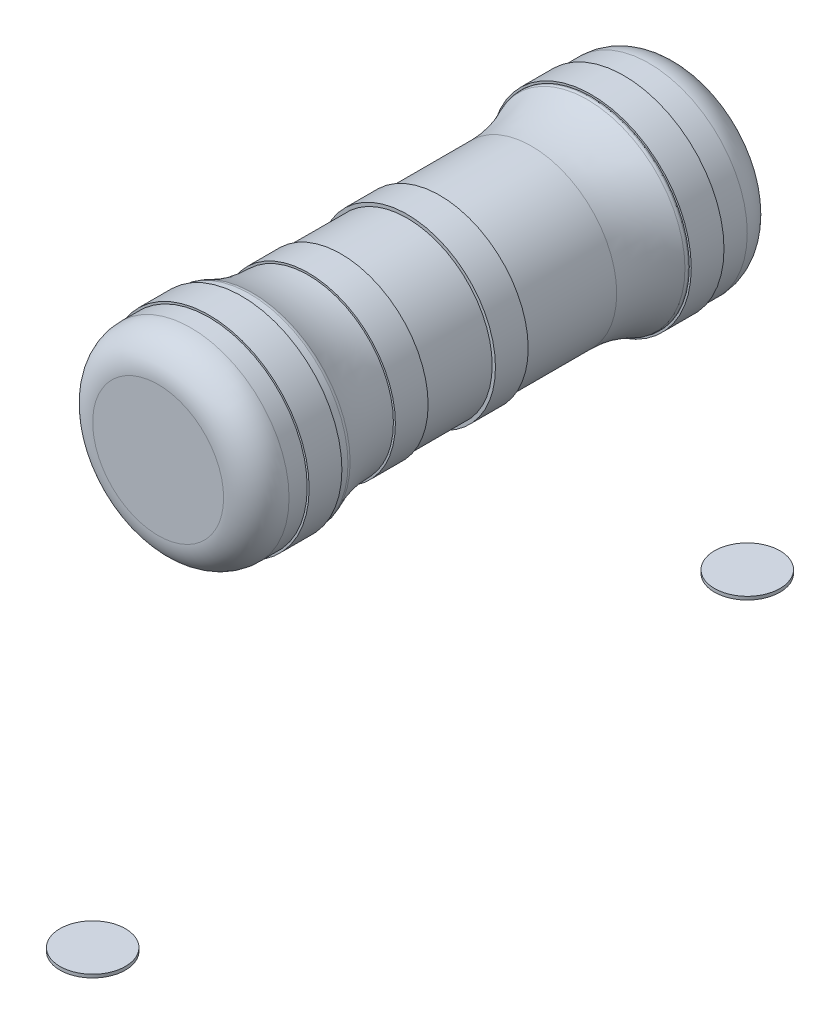
ISO-10303-21;
HEADER;
FILE_DESCRIPTION(('STEP AP214'),'2;1');
FILE_NAME('part.step','',(''),(''),'','','');
FILE_SCHEMA(('AUTOMOTIVE_DESIGN { 1 0 10303 214 1 1 1 1 }'));
ENDSEC;
DATA;
#1=APPLICATION_CONTEXT('core data for automotive mechanical design processes');
#2=APPLICATION_PROTOCOL_DEFINITION('international standard','automotive_design',2000,#1);
#3=PRODUCT_CONTEXT('',#1,'mechanical');
#4=PRODUCT('Part','Part','',(#3));
#5=PRODUCT_RELATED_PRODUCT_CATEGORY('part','',(#4));
#6=PRODUCT_DEFINITION_FORMATION('','',#4);
#7=PRODUCT_DEFINITION_CONTEXT('part definition',#1,'design');
#8=PRODUCT_DEFINITION('design','',#6,#7);
#9=PRODUCT_DEFINITION_SHAPE('','',#8);
#10=(LENGTH_UNIT() NAMED_UNIT(*) SI_UNIT(.MILLI.,.METRE.));
#11=(NAMED_UNIT(*) PLANE_ANGLE_UNIT() SI_UNIT($,.RADIAN.));
#12=(NAMED_UNIT(*) SI_UNIT($,.STERADIAN.) SOLID_ANGLE_UNIT());
#13=UNCERTAINTY_MEASURE_WITH_UNIT(LENGTH_MEASURE(1.E-05),#10,'distance_accuracy_value','');
#14=(GEOMETRIC_REPRESENTATION_CONTEXT(3) GLOBAL_UNCERTAINTY_ASSIGNED_CONTEXT((#13)) GLOBAL_UNIT_ASSIGNED_CONTEXT((#10,
#11,#12)) REPRESENTATION_CONTEXT('',''));
#15=CARTESIAN_POINT('',(0.,0.,0.));
#16=DIRECTION('',(0.,0.,1.));
#17=DIRECTION('',(1.,0.,0.));
#18=AXIS2_PLACEMENT_3D('',#15,#16,#17);
#19=CARTESIAN_POINT('',(0.,-5.95,5.));
#20=DIRECTION('',(0.,-1.,0.));
#21=DIRECTION('',(0.,0.,-1.));
#22=AXIS2_PLACEMENT_3D('',#19,#20,#21);
#23=CYLINDRICAL_SURFACE('',#22,0.5);
#24=CARTESIAN_POINT('',(0.,-5.95,5.));
#25=DIRECTION('',(0.,1.,0.));
#26=DIRECTION('',(0.,0.,1.));
#27=AXIS2_PLACEMENT_3D('',#24,#25,#26);
#28=CIRCLE('',#27,0.5);
#29=CARTESIAN_POINT('',(0.,-5.95,5.5));
#30=VERTEX_POINT('',#29);
#31=EDGE_CURVE('E11',#30,#30,#28,.T.);
#32=ORIENTED_EDGE('',*,*,#31,.F.);
#33=EDGE_LOOP('',(#32));
#34=FACE_BOUND('',#33,.T.);
#35=CARTESIAN_POINT('',(0.,-6.,5.));
#36=DIRECTION('',(0.,1.,0.));
#37=DIRECTION('',(0.,0.,1.));
#38=AXIS2_PLACEMENT_3D('',#35,#36,#37);
#39=CIRCLE('',#38,0.5);
#40=CARTESIAN_POINT('',(0.,-6.,5.5));
#41=VERTEX_POINT('',#40);
#42=EDGE_CURVE('E47',#41,#41,#39,.T.);
#43=ORIENTED_EDGE('',*,*,#42,.T.);
#44=EDGE_LOOP('',(#43));
#45=FACE_BOUND('',#44,.T.);
#46=ADVANCED_FACE('F44',(#34,#45),#23,.T.);
#47=CARTESIAN_POINT('',(0.,-5.95,0.));
#48=DIRECTION('',(0.,1.,0.));
#49=DIRECTION('',(0.,0.,1.));
#50=AXIS2_PLACEMENT_3D('',#47,#48,#49);
#51=PLANE('',#50);
#52=ORIENTED_EDGE('',*,*,#31,.T.);
#53=EDGE_LOOP('',(#52));
#54=FACE_BOUND('',#53,.T.);
#55=ADVANCED_FACE('F59',(#54),#51,.T.);
#56=CARTESIAN_POINT('',(0.,-6.,0.));
#57=DIRECTION('',(0.,1.,0.));
#58=DIRECTION('',(0.,0.,1.));
#59=AXIS2_PLACEMENT_3D('',#56,#57,#58);
#60=PLANE('',#59);
#61=ORIENTED_EDGE('',*,*,#42,.F.);
#62=EDGE_LOOP('',(#61));
#63=FACE_BOUND('',#62,.T.);
#64=ADVANCED_FACE('F57',(#63),#60,.F.);
#65=CLOSED_SHELL('',(#46,#55,#64));
#66=MANIFOLD_SOLID_BREP('B2',#65);
#67=CARTESIAN_POINT('',(0.,-5.95,-5.));
#68=DIRECTION('',(0.,-1.,0.));
#69=DIRECTION('',(0.,0.,-1.));
#70=AXIS2_PLACEMENT_3D('',#67,#68,#69);
#71=CYLINDRICAL_SURFACE('',#70,0.5);
#72=CARTESIAN_POINT('',(0.,-5.95,-5.));
#73=DIRECTION('',(0.,1.,0.));
#74=DIRECTION('',(0.,0.,1.));
#75=AXIS2_PLACEMENT_3D('',#72,#73,#74);
#76=CIRCLE('',#75,0.5);
#77=CARTESIAN_POINT('',(0.,-5.95,-4.5));
#78=VERTEX_POINT('',#77);
#79=EDGE_CURVE('E43',#78,#78,#76,.T.);
#80=ORIENTED_EDGE('',*,*,#79,.F.);
#81=EDGE_LOOP('',(#80));
#82=FACE_BOUND('',#81,.T.);
#83=CARTESIAN_POINT('',(0.,-6.,-5.));
#84=DIRECTION('',(0.,1.,0.));
#85=DIRECTION('',(0.,0.,1.));
#86=AXIS2_PLACEMENT_3D('',#83,#84,#85);
#87=CIRCLE('',#86,0.5);
#88=CARTESIAN_POINT('',(0.,-6.,-4.5));
#89=VERTEX_POINT('',#88);
#90=EDGE_CURVE('E104',#89,#89,#87,.T.);
#91=ORIENTED_EDGE('',*,*,#90,.T.);
#92=EDGE_LOOP('',(#91));
#93=FACE_BOUND('',#92,.T.);
#94=ADVANCED_FACE('F101',(#82,#93),#71,.T.);
#95=CARTESIAN_POINT('',(0.,-5.95,-5.));
#96=DIRECTION('',(0.,1.,0.));
#97=DIRECTION('',(0.,0.,1.));
#98=AXIS2_PLACEMENT_3D('',#95,#96,#97);
#99=PLANE('',#98);
#100=ORIENTED_EDGE('',*,*,#79,.T.);
#101=EDGE_LOOP('',(#100));
#102=FACE_BOUND('',#101,.T.);
#103=ADVANCED_FACE('F116',(#102),#99,.T.);
#104=CARTESIAN_POINT('',(0.,-6.,-5.));
#105=DIRECTION('',(0.,1.,0.));
#106=DIRECTION('',(0.,0.,1.));
#107=AXIS2_PLACEMENT_3D('',#104,#105,#106);
#108=PLANE('',#107);
#109=ORIENTED_EDGE('',*,*,#90,.F.);
#110=EDGE_LOOP('',(#109));
#111=FACE_BOUND('',#110,.T.);
#112=ADVANCED_FACE('F114',(#111),#108,.F.);
#113=CLOSED_SHELL('',(#94,#103,#112));
#114=MANIFOLD_SOLID_BREP('B6',#113);
#115=CARTESIAN_POINT('',(0.,0.,-4.));
#116=DIRECTION('',(0.,0.,-1.));
#117=DIRECTION('',(-1.,0.,0.));
#118=AXIS2_PLACEMENT_3D('',#115,#116,#117);
#119=CYLINDRICAL_SURFACE('',#118,0.5);
#120=CARTESIAN_POINT('',(0.,0.,-4.));
#121=DIRECTION('',(0.,0.,-1.));
#122=DIRECTION('',(-1.,0.,0.));
#123=AXIS2_PLACEMENT_3D('',#120,#121,#122);
#124=CIRCLE('',#123,0.5);
#125=CARTESIAN_POINT('',(-0.5,0.,-4.));
#126=VERTEX_POINT('',#125);
#127=EDGE_CURVE('E158',#126,#126,#124,.T.);
#128=ORIENTED_EDGE('',*,*,#127,.T.);
#129=EDGE_LOOP('',(#128));
#130=FACE_BOUND('',#129,.T.);
#131=CARTESIAN_POINT('',(0.,0.,-4.5));
#132=DIRECTION('',(0.,0.,-1.));
#133=DIRECTION('',(-1.,0.,0.));
#134=AXIS2_PLACEMENT_3D('',#131,#132,#133);
#135=CIRCLE('',#134,0.5);
#136=CARTESIAN_POINT('',(0.,-0.5,-4.5));
#137=VERTEX_POINT('',#136);
#138=EDGE_CURVE('E99',#137,#137,#135,.T.);
#139=ORIENTED_EDGE('',*,*,#138,.F.);
#140=EDGE_LOOP('',(#139));
#141=FACE_BOUND('',#140,.T.);
#142=ADVANCED_FACE('F152',(#130,#141),#119,.T.);
#143=CARTESIAN_POINT('',(0.,-0.5,-4.5));
#144=DIRECTION('',(-1.,0.,0.));
#145=DIRECTION('',(0.,0.,1.));
#146=AXIS2_PLACEMENT_3D('',#143,#144,#145);
#147=DEGENERATE_TOROIDAL_SURFACE('',#146,0.5,0.5,.T.);
#148=CARTESIAN_POINT('',(0.,-0.5,-5.));
#149=DIRECTION('',(0.,-1.,0.));
#150=DIRECTION('',(-1.,0.,0.));
#151=AXIS2_PLACEMENT_3D('',#148,#149,#150);
#152=CIRCLE('',#151,0.5);
#153=EDGE_CURVE('E163',#137,#137,#152,.T.);
#154=ORIENTED_EDGE('',*,*,#153,.F.);
#155=ORIENTED_EDGE('',*,*,#138,.T.);
#156=EDGE_LOOP('',(#154,#155));
#157=FACE_BOUND('',#156,.T.);
#158=ADVANCED_FACE('F175',(#157),#147,.T.);
#159=CARTESIAN_POINT('',(0.,-0.5,-5.));
#160=DIRECTION('',(0.,-1.,0.));
#161=DIRECTION('',(0.,0.,-1.));
#162=AXIS2_PLACEMENT_3D('',#159,#160,#161);
#163=CYLINDRICAL_SURFACE('',#162,0.5);
#164=ORIENTED_EDGE('',*,*,#153,.T.);
#165=EDGE_LOOP('',(#164));
#166=FACE_BOUND('',#165,.T.);
#167=CARTESIAN_POINT('',(0.,-6.,-5.));
#168=DIRECTION('',(0.,-1.,0.));
#169=DIRECTION('',(-1.,0.,0.));
#170=AXIS2_PLACEMENT_3D('',#167,#168,#169);
#171=CIRCLE('',#170,0.5);
#172=CARTESIAN_POINT('',(-0.5,-6.,-5.));
#173=VERTEX_POINT('',#172);
#174=EDGE_CURVE('E155',#173,#173,#171,.T.);
#175=ORIENTED_EDGE('',*,*,#174,.F.);
#176=EDGE_LOOP('',(#175));
#177=FACE_BOUND('',#176,.T.);
#178=ADVANCED_FACE('F153',(#166,#177),#163,.T.);
#179=OPEN_SHELL('',(#142,#158,#178));
#180=SHELL_BASED_SURFACE_MODEL('B38',(#179));
#181=CARTESIAN_POINT('',(0.,0.,4.00287776352005));
#182=DIRECTION('',(0.,0.,1.));
#183=DIRECTION('',(1.,0.,0.));
#184=AXIS2_PLACEMENT_3D('',#181,#182,#183);
#185=CYLINDRICAL_SURFACE('',#184,0.5);
#186=CARTESIAN_POINT('',(0.,0.,4.00287776352005));
#187=DIRECTION('',(0.,0.,1.));
#188=DIRECTION('',(1.,0.,0.));
#189=AXIS2_PLACEMENT_3D('',#186,#187,#188);
#190=CIRCLE('',#189,0.5);
#191=CARTESIAN_POINT('',(0.5,0.,4.00287776352005));
#192=VERTEX_POINT('',#191);
#193=EDGE_CURVE('E219',#192,#192,#190,.T.);
#194=ORIENTED_EDGE('',*,*,#193,.T.);
#195=EDGE_LOOP('',(#194));
#196=FACE_BOUND('',#195,.T.);
#197=CARTESIAN_POINT('',(0.,0.,4.5));
#198=DIRECTION('',(0.,0.,1.));
#199=DIRECTION('',(1.,0.,0.));
#200=AXIS2_PLACEMENT_3D('',#197,#198,#199);
#201=CIRCLE('',#200,0.5);
#202=CARTESIAN_POINT('',(0.,-0.5,4.5));
#203=VERTEX_POINT('',#202);
#204=EDGE_CURVE('E150',#203,#203,#201,.T.);
#205=ORIENTED_EDGE('',*,*,#204,.F.);
#206=EDGE_LOOP('',(#205));
#207=FACE_BOUND('',#206,.T.);
#208=ADVANCED_FACE('F213',(#196,#207),#185,.T.);
#209=CARTESIAN_POINT('',(0.,-0.5,4.));
#210=DIRECTION('',(0.,-1.,0.));
#211=DIRECTION('',(0.,0.,-1.));
#212=AXIS2_PLACEMENT_3D('',#209,#210,#211);
#213=CIRCLE('',#212,0.5);
#214=TRIMMED_CURVE('',#213,(PARAMETER_VALUE(-3.14159263251637)),
(PARAMETER_VALUE(3.14159263251637)),.T.,.PARAMETER.);
#215=CARTESIAN_POINT('',(0.,-0.5,4.5));
#216=DIRECTION('',(1.,0.,0.));
#217=AXIS1_PLACEMENT('',#215,#216);
#218=SURFACE_OF_REVOLUTION('',#214,#217);
#219=CARTESIAN_POINT('',(0.,-0.500000000000004,5.));
#220=DIRECTION('',(0.,-1.,0.));
#221=DIRECTION('',(1.,0.,0.));
#222=AXIS2_PLACEMENT_3D('',#219,#220,#221);
#223=CIRCLE('',#222,0.5);
#224=EDGE_CURVE('E224',#203,#203,#223,.T.);
#225=ORIENTED_EDGE('',*,*,#224,.F.);
#226=ORIENTED_EDGE('',*,*,#204,.T.);
#227=EDGE_LOOP('',(#225,#226));
#228=FACE_BOUND('',#227,.T.);
#229=ADVANCED_FACE('F236',(#228),#218,.T.);
#230=CARTESIAN_POINT('',(0.,-0.500000000000004,5.));
#231=DIRECTION('',(0.,-1.,0.));
#232=DIRECTION('',(0.,0.,-1.));
#233=AXIS2_PLACEMENT_3D('',#230,#231,#232);
#234=CYLINDRICAL_SURFACE('',#233,0.5);
#235=ORIENTED_EDGE('',*,*,#224,.T.);
#236=EDGE_LOOP('',(#235));
#237=FACE_BOUND('',#236,.T.);
#238=CARTESIAN_POINT('',(0.,-6.,5.));
#239=DIRECTION('',(0.,-1.,0.));
#240=DIRECTION('',(1.,0.,0.));
#241=AXIS2_PLACEMENT_3D('',#238,#239,#240);
#242=CIRCLE('',#241,0.5);
#243=CARTESIAN_POINT('',(0.5,-6.,5.));
#244=VERTEX_POINT('',#243);
#245=EDGE_CURVE('E216',#244,#244,#242,.T.);
#246=ORIENTED_EDGE('',*,*,#245,.F.);
#247=EDGE_LOOP('',(#246));
#248=FACE_BOUND('',#247,.T.);
#249=ADVANCED_FACE('F214',(#237,#248),#234,.T.);
#250=OPEN_SHELL('',(#208,#229,#249));
#251=SHELL_BASED_SURFACE_MODEL('B93',(#250));
#252=CARTESIAN_POINT('',(0.,0.,30.9468802698145));
#253=DIRECTION('',(0.,0.,1.));
#254=DIRECTION('',(1.,0.,0.));
#255=AXIS2_PLACEMENT_3D('',#252,#253,#254);
#256=CYLINDRICAL_SURFACE('',#255,1.5);
#257=CARTESIAN_POINT('',(0.,0.,-2.6));
#258=DIRECTION('',(0.,0.,1.));
#259=DIRECTION('',(1.,0.,0.));
#260=AXIS2_PLACEMENT_3D('',#257,#258,#259);
#261=CIRCLE('',#260,1.5);
#262=CARTESIAN_POINT('',(1.5,0.,-2.6));
#263=VERTEX_POINT('',#262);
#264=EDGE_CURVE('E314',#263,#263,#261,.T.);
#265=ORIENTED_EDGE('',*,*,#264,.F.);
#266=EDGE_LOOP('',(#265));
#267=FACE_BOUND('',#266,.T.);
#268=CARTESIAN_POINT('',(0.,0.,-2.61454960934726));
#269=DIRECTION('',(0.,0.,-1.));
#270=DIRECTION('',(-1.,0.,0.));
#271=AXIS2_PLACEMENT_3D('',#268,#269,#270);
#272=CIRCLE('',#271,1.5);
#273=CARTESIAN_POINT('',(-1.5,0.,-2.61454960934726));
#274=VERTEX_POINT('',#273);
#275=EDGE_CURVE('E212',#274,#274,#272,.T.);
#276=ORIENTED_EDGE('',*,*,#275,.F.);
#277=EDGE_LOOP('',(#276));
#278=FACE_BOUND('',#277,.T.);
#279=ADVANCED_FACE('F267',(#267,#278),#256,.T.);
#280=CARTESIAN_POINT('',(0.,0.,30.9468802698145));
#281=DIRECTION('',(0.,0.,1.));
#282=DIRECTION('',(1.,0.,0.));
#283=AXIS2_PLACEMENT_3D('',#280,#281,#282);
#284=CYLINDRICAL_SURFACE('',#283,1.5);
#285=CARTESIAN_POINT('',(0.,0.,2.6));
#286=DIRECTION('',(0.,0.,1.));
#287=DIRECTION('',(1.,0.,0.));
#288=AXIS2_PLACEMENT_3D('',#285,#286,#287);
#289=CIRCLE('',#288,1.5);
#290=CARTESIAN_POINT('',(1.5,0.,2.6));
#291=VERTEX_POINT('',#290);
#292=EDGE_CURVE('E317',#291,#291,#289,.T.);
#293=ORIENTED_EDGE('',*,*,#292,.T.);
#294=EDGE_LOOP('',(#293));
#295=FACE_BOUND('',#294,.T.);
#296=CARTESIAN_POINT('',(0.,0.,2.7227576675328));
#297=DIRECTION('',(0.,0.,1.));
#298=DIRECTION('',(1.,0.,0.));
#299=AXIS2_PLACEMENT_3D('',#296,#297,#298);
#300=CIRCLE('',#299,1.5);
#301=CARTESIAN_POINT('',(1.5,0.,2.7227576675328));
#302=VERTEX_POINT('',#301);
#303=EDGE_CURVE('E282',#302,#302,#300,.T.);
#304=ORIENTED_EDGE('',*,*,#303,.F.);
#305=EDGE_LOOP('',(#304));
#306=FACE_BOUND('',#305,.T.);
#307=ADVANCED_FACE('F369',(#295,#306),#284,.T.);
#308=CARTESIAN_POINT('',(0.,0.,30.9468802698145));
#309=DIRECTION('',(0.,0.,1.));
#310=DIRECTION('',(1.,0.,0.));
#311=AXIS2_PLACEMENT_3D('',#308,#309,#310);
#312=CYLINDRICAL_SURFACE('',#311,1.3);
#313=CARTESIAN_POINT('',(0.,0.,1.20557280899656));
#314=DIRECTION('',(0.,0.,1.));
#315=DIRECTION('',(1.,0.,0.));
#316=AXIS2_PLACEMENT_3D('',#313,#314,#315);
#317=CIRCLE('',#316,1.3);
#318=CARTESIAN_POINT('',(1.3,0.,1.20557280899656));
#319=VERTEX_POINT('',#318);
#320=EDGE_CURVE('E293',#319,#319,#317,.T.);
#321=ORIENTED_EDGE('',*,*,#320,.F.);
#322=EDGE_LOOP('',(#321));
#323=FACE_BOUND('',#322,.T.);
#324=CARTESIAN_POINT('',(0.,0.,0.196800451709014));
#325=DIRECTION('',(0.,0.,-1.));
#326=DIRECTION('',(-1.,0.,0.));
#327=AXIS2_PLACEMENT_3D('',#324,#325,#326);
#328=CIRCLE('',#327,1.3);
#329=CARTESIAN_POINT('',(-1.3,0.,0.196800451709014));
#330=VERTEX_POINT('',#329);
#331=EDGE_CURVE('E287',#330,#330,#328,.T.);
#332=ORIENTED_EDGE('',*,*,#331,.F.);
#333=EDGE_LOOP('',(#332));
#334=FACE_BOUND('',#333,.T.);
#335=ADVANCED_FACE('F376',(#323,#334),#312,.T.);
#336=CARTESIAN_POINT('',(0.,1.3,1.70557280899656));
#337=DIRECTION('',(0.,0.,-1.));
#338=DIRECTION('',(-1.,0.,0.));
#339=AXIS2_PLACEMENT_3D('',#336,#337,#338);
#340=PLANE('',#339);
#341=CARTESIAN_POINT('',(0.,0.,1.70557280899656));
#342=DIRECTION('',(0.,0.,1.));
#343=DIRECTION('',(1.,0.,0.));
#344=AXIS2_PLACEMENT_3D('',#341,#342,#343);
#345=CIRCLE('',#344,1.3);
#346=CARTESIAN_POINT('',(1.3,0.,1.70557280899656));
#347=VERTEX_POINT('',#346);
#348=EDGE_CURVE('E299',#347,#347,#345,.F.);
#349=ORIENTED_EDGE('',*,*,#348,.T.);
#350=EDGE_LOOP('',(#349));
#351=FACE_BOUND('',#350,.T.);
#352=CARTESIAN_POINT('',(0.,0.,1.70557280899656));
#353=DIRECTION('',(0.,0.,1.));
#354=DIRECTION('',(1.,0.,0.));
#355=AXIS2_PLACEMENT_3D('',#352,#353,#354);
#356=CIRCLE('',#355,1.32999160819457);
#357=CARTESIAN_POINT('',(1.32999160819457,0.,1.70557280899656));
#358=VERTEX_POINT('',#357);
#359=EDGE_CURVE('E326',#358,#358,#356,.T.);
#360=ORIENTED_EDGE('',*,*,#359,.T.);
#361=EDGE_LOOP('',(#360));
#362=FACE_BOUND('',#361,.T.);
#363=ADVANCED_FACE('F454',(#351,#362),#340,.F.);
#364=CARTESIAN_POINT('',(0.,0.,2.18472406688181));
#365=DIRECTION('',(0.,0.,1.));
#366=DIRECTION('',(1.,0.,0.));
#367=AXIS2_PLACEMENT_3D('',#364,#365,#366);
#368=CYLINDRICAL_SURFACE('',#367,1.32999160819457);
#369=ORIENTED_EDGE('',*,*,#359,.F.);
#370=EDGE_LOOP('',(#369));
#371=FACE_BOUND('',#370,.T.);
#372=CARTESIAN_POINT('',(0.,0.,1.20557280899656));
#373=DIRECTION('',(0.,0.,1.));
#374=DIRECTION('',(1.,0.,0.));
#375=AXIS2_PLACEMENT_3D('',#372,#373,#374);
#376=CIRCLE('',#375,1.32999160819457);
#377=CARTESIAN_POINT('',(1.32999160819457,0.,1.20557280899656));
#378=VERTEX_POINT('',#377);
#379=EDGE_CURVE('E329',#378,#378,#376,.T.);
#380=ORIENTED_EDGE('',*,*,#379,.T.);
#381=EDGE_LOOP('',(#380));
#382=FACE_BOUND('',#381,.T.);
#383=ADVANCED_FACE('F450',(#371,#382),#368,.T.);
#384=CARTESIAN_POINT('',(0.,1.3,1.20557280899656));
#385=DIRECTION('',(0.,0.,1.));
#386=DIRECTION('',(1.,0.,0.));
#387=AXIS2_PLACEMENT_3D('',#384,#385,#386);
#388=PLANE('',#387);
#389=ORIENTED_EDGE('',*,*,#379,.F.);
#390=EDGE_LOOP('',(#389));
#391=FACE_BOUND('',#390,.T.);
#392=ORIENTED_EDGE('',*,*,#320,.T.);
#393=EDGE_LOOP('',(#392));
#394=FACE_BOUND('',#393,.T.);
#395=ADVANCED_FACE('F411',(#391,#394),#388,.F.);
#396=CARTESIAN_POINT('',(0.,0.,2.6));
#397=DIRECTION('',(0.,0.,1.));
#398=DIRECTION('',(1.,0.,0.));
#399=AXIS2_PLACEMENT_3D('',#396,#397,#398);
#400=TOROIDAL_SURFACE('',#399,1.4,0.0999999999999999);
#401=CARTESIAN_POINT('',(0.,0.,2.55740822899985));
#402=DIRECTION('',(0.,0.,1.));
#403=DIRECTION('',(1.,0.,0.));
#404=AXIS2_PLACEMENT_3D('',#401,#402,#403);
#405=CIRCLE('',#404,1.49047619047612);
#406=CARTESIAN_POINT('',(1.49047619047612,0.,2.55740822899985));
#407=VERTEX_POINT('',#406);
#408=EDGE_CURVE('E305',#407,#407,#405,.T.);
#409=ORIENTED_EDGE('',*,*,#408,.T.);
#410=EDGE_LOOP('',(#409));
#411=FACE_BOUND('',#410,.T.);
#412=ORIENTED_EDGE('',*,*,#292,.F.);
#413=EDGE_LOOP('',(#412));
#414=FACE_BOUND('',#413,.T.);
#415=ADVANCED_FACE('F402',(#411,#414),#400,.T.);
#416=CARTESIAN_POINT('',(0.,0.,1.70557280899656));
#417=DIRECTION('',(0.,0.,1.));
#418=DIRECTION('',(1.,0.,0.));
#419=AXIS2_PLACEMENT_3D('',#416,#417,#418);
#420=TOROIDAL_SURFACE('',#419,3.29999999999925,2.);
#421=ORIENTED_EDGE('',*,*,#348,.F.);
#422=EDGE_LOOP('',(#421));
#423=FACE_BOUND('',#422,.T.);
#424=ORIENTED_EDGE('',*,*,#408,.F.);
#425=EDGE_LOOP('',(#424));
#426=FACE_BOUND('',#425,.T.);
#427=ADVANCED_FACE('F399',(#423,#426),#420,.F.);
#428=CARTESIAN_POINT('',(0.,1.35,0.196800451709014));
#429=DIRECTION('',(0.,0.,-1.));
#430=DIRECTION('',(-1.,0.,0.));
#431=AXIS2_PLACEMENT_3D('',#428,#429,#430);
#432=PLANE('',#431);
#433=ORIENTED_EDGE('',*,*,#331,.T.);
#434=EDGE_LOOP('',(#433));
#435=FACE_BOUND('',#434,.T.);
#436=CARTESIAN_POINT('',(0.,0.,0.196800451709014));
#437=DIRECTION('',(0.,0.,1.));
#438=DIRECTION('',(1.,0.,0.));
#439=AXIS2_PLACEMENT_3D('',#436,#437,#438);
#440=CIRCLE('',#439,1.35);
#441=CARTESIAN_POINT('',(1.35,0.,0.196800451709014));
#442=VERTEX_POINT('',#441);
#443=EDGE_CURVE('E335',#442,#442,#440,.T.);
#444=ORIENTED_EDGE('',*,*,#443,.T.);
#445=EDGE_LOOP('',(#444));
#446=FACE_BOUND('',#445,.T.);
#447=ADVANCED_FACE('F401',(#435,#446),#432,.F.);
#448=CARTESIAN_POINT('',(0.,1.35,-0.303199548290986));
#449=DIRECTION('',(0.,0.,1.));
#450=DIRECTION('',(1.,0.,0.));
#451=AXIS2_PLACEMENT_3D('',#448,#449,#450);
#452=PLANE('',#451);
#453=CARTESIAN_POINT('',(0.,0.,-0.303199548290986));
#454=DIRECTION('',(0.,0.,1.));
#455=DIRECTION('',(1.,0.,0.));
#456=AXIS2_PLACEMENT_3D('',#453,#454,#455);
#457=CIRCLE('',#456,1.35);
#458=CARTESIAN_POINT('',(1.35,0.,-0.303199548290986));
#459=VERTEX_POINT('',#458);
#460=EDGE_CURVE('E332',#459,#459,#457,.T.);
#461=ORIENTED_EDGE('',*,*,#460,.F.);
#462=EDGE_LOOP('',(#461));
#463=FACE_BOUND('',#462,.T.);
#464=CARTESIAN_POINT('',(0.,0.,-0.303199548290986));
#465=DIRECTION('',(0.,0.,1.));
#466=DIRECTION('',(1.,0.,0.));
#467=AXIS2_PLACEMENT_3D('',#464,#465,#466);
#468=CIRCLE('',#467,1.3);
#469=CARTESIAN_POINT('',(1.3,0.,-0.303199548290986));
#470=VERTEX_POINT('',#469);
#471=EDGE_CURVE('E290',#470,#470,#468,.T.);
#472=ORIENTED_EDGE('',*,*,#471,.T.);
#473=EDGE_LOOP('',(#472));
#474=FACE_BOUND('',#473,.T.);
#475=ADVANCED_FACE('F408',(#463,#474),#452,.F.);
#476=CARTESIAN_POINT('',(0.,0.,0.489395269526655));
#477=DIRECTION('',(0.,0.,1.));
#478=DIRECTION('',(1.,0.,0.));
#479=AXIS2_PLACEMENT_3D('',#476,#477,#478);
#480=CYLINDRICAL_SURFACE('',#479,1.35);
#481=ORIENTED_EDGE('',*,*,#443,.F.);
#482=EDGE_LOOP('',(#481));
#483=FACE_BOUND('',#482,.T.);
#484=ORIENTED_EDGE('',*,*,#460,.T.);
#485=EDGE_LOOP('',(#484));
#486=FACE_BOUND('',#485,.T.);
#487=ADVANCED_FACE('F440',(#483,#486),#480,.T.);
#488=CARTESIAN_POINT('',(0.,0.,-2.6));
#489=DIRECTION('',(0.,0.,1.));
#490=DIRECTION('',(1.,0.,0.));
#491=AXIS2_PLACEMENT_3D('',#488,#489,#490);
#492=TOROIDAL_SURFACE('',#491,1.4,0.0999999999999998);
#493=CARTESIAN_POINT('',(0.,0.,-2.55740822899985));
#494=DIRECTION('',(0.,0.,-1.));
#495=DIRECTION('',(-1.,0.,0.));
#496=AXIS2_PLACEMENT_3D('',#493,#494,#495);
#497=CIRCLE('',#496,1.49047619047612);
#498=CARTESIAN_POINT('',(-1.49047619047612,0.,-2.55740822899985));
#499=VERTEX_POINT('',#498);
#500=EDGE_CURVE('E296',#499,#499,#497,.T.);
#501=ORIENTED_EDGE('',*,*,#500,.T.);
#502=EDGE_LOOP('',(#501));
#503=FACE_BOUND('',#502,.T.);
#504=ORIENTED_EDGE('',*,*,#264,.T.);
#505=EDGE_LOOP('',(#504));
#506=FACE_BOUND('',#505,.T.);
#507=ADVANCED_FACE('F443',(#503,#506),#492,.T.);
#508=CARTESIAN_POINT('',(0.,0.,-1.70557280899656));
#509=DIRECTION('',(0.,0.,1.));
#510=DIRECTION('',(1.,0.,0.));
#511=AXIS2_PLACEMENT_3D('',#508,#509,#510);
#512=TOROIDAL_SURFACE('',#511,3.29999999999925,2.);
#513=ORIENTED_EDGE('',*,*,#500,.F.);
#514=EDGE_LOOP('',(#513));
#515=FACE_BOUND('',#514,.T.);
#516=CARTESIAN_POINT('',(0.,0.,-1.70557280899657));
#517=DIRECTION('',(0.,0.,1.));
#518=DIRECTION('',(1.,0.,0.));
#519=AXIS2_PLACEMENT_3D('',#516,#517,#518);
#520=CIRCLE('',#519,1.3);
#521=CARTESIAN_POINT('',(1.3,0.,-1.70557280899657));
#522=VERTEX_POINT('',#521);
#523=EDGE_CURVE('E302',#522,#522,#520,.T.);
#524=ORIENTED_EDGE('',*,*,#523,.F.);
#525=EDGE_LOOP('',(#524));
#526=FACE_BOUND('',#525,.T.);
#527=ADVANCED_FACE('F269',(#515,#526),#512,.F.);
#528=ORIENTED_EDGE('',*,*,#523,.T.);
#529=EDGE_LOOP('',(#528));
#530=FACE_BOUND('',#529,.T.);
#531=ORIENTED_EDGE('',*,*,#471,.F.);
#532=EDGE_LOOP('',(#531));
#533=FACE_BOUND('',#532,.T.);
#534=ADVANCED_FACE('F435',(#530,#533),#312,.T.);
#535=CARTESIAN_POINT('',(0.,1.53,3.2227576675328));
#536=DIRECTION('',(0.,0.,-1.));
#537=DIRECTION('',(-1.,0.,0.));
#538=AXIS2_PLACEMENT_3D('',#535,#536,#537);
#539=PLANE('',#538);
#540=CARTESIAN_POINT('',(0.,0.,3.2227576675328));
#541=DIRECTION('',(0.,0.,-1.));
#542=DIRECTION('',(-1.,0.,0.));
#543=AXIS2_PLACEMENT_3D('',#540,#541,#542);
#544=CIRCLE('',#543,1.5);
#545=CARTESIAN_POINT('',(-1.5,0.,3.2227576675328));
#546=VERTEX_POINT('',#545);
#547=EDGE_CURVE('E278',#546,#546,#544,.T.);
#548=ORIENTED_EDGE('',*,*,#547,.T.);
#549=EDGE_LOOP('',(#548));
#550=FACE_BOUND('',#549,.T.);
#551=CARTESIAN_POINT('',(0.,0.,3.2227576675328));
#552=DIRECTION('',(0.,0.,1.));
#553=DIRECTION('',(1.,0.,0.));
#554=AXIS2_PLACEMENT_3D('',#551,#552,#553);
#555=CIRCLE('',#554,1.53);
#556=CARTESIAN_POINT('',(1.53,0.,3.2227576675328));
#557=VERTEX_POINT('',#556);
#558=EDGE_CURVE('E341',#557,#557,#555,.T.);
#559=ORIENTED_EDGE('',*,*,#558,.T.);
#560=EDGE_LOOP('',(#559));
#561=FACE_BOUND('',#560,.T.);
#562=ADVANCED_FACE('F425',(#550,#561),#539,.F.);
#563=CARTESIAN_POINT('',(0.,1.53,2.7227576675328));
#564=DIRECTION('',(0.,0.,1.));
#565=DIRECTION('',(1.,0.,0.));
#566=AXIS2_PLACEMENT_3D('',#563,#564,#565);
#567=PLANE('',#566);
#568=CARTESIAN_POINT('',(0.,0.,2.7227576675328));
#569=DIRECTION('',(0.,0.,1.));
#570=DIRECTION('',(1.,0.,0.));
#571=AXIS2_PLACEMENT_3D('',#568,#569,#570);
#572=CIRCLE('',#571,1.53);
#573=CARTESIAN_POINT('',(1.53,0.,2.7227576675328));
#574=VERTEX_POINT('',#573);
#575=EDGE_CURVE('E338',#574,#574,#572,.T.);
#576=ORIENTED_EDGE('',*,*,#575,.F.);
#577=EDGE_LOOP('',(#576));
#578=FACE_BOUND('',#577,.T.);
#579=ORIENTED_EDGE('',*,*,#303,.T.);
#580=EDGE_LOOP('',(#579));
#581=FACE_BOUND('',#580,.T.);
#582=ADVANCED_FACE('F422',(#578,#581),#567,.F.);
#583=CARTESIAN_POINT('',(0.,0.,0.449237837598222));
#584=DIRECTION('',(0.,0.,1.));
#585=DIRECTION('',(1.,0.,0.));
#586=AXIS2_PLACEMENT_3D('',#583,#584,#585);
#587=CYLINDRICAL_SURFACE('',#586,1.53);
#588=ORIENTED_EDGE('',*,*,#558,.F.);
#589=EDGE_LOOP('',(#588));
#590=FACE_BOUND('',#589,.T.);
#591=ORIENTED_EDGE('',*,*,#575,.T.);
#592=EDGE_LOOP('',(#591));
#593=FACE_BOUND('',#592,.T.);
#594=ADVANCED_FACE('F424',(#590,#593),#587,.T.);
#595=CARTESIAN_POINT('',(0.,1.,4.));
#596=DIRECTION('',(0.,0.,-1.));
#597=DIRECTION('',(-1.,0.,0.));
#598=AXIS2_PLACEMENT_3D('',#595,#596,#597);
#599=PLANE('',#598);
#600=CARTESIAN_POINT('',(0.,0.,4.));
#601=DIRECTION('',(0.,0.,1.));
#602=DIRECTION('',(1.,0.,0.));
#603=AXIS2_PLACEMENT_3D('',#600,#601,#602);
#604=CIRCLE('',#603,1.);
#605=CARTESIAN_POINT('',(1.,0.,4.));
#606=VERTEX_POINT('',#605);
#607=EDGE_CURVE('E323',#606,#606,#604,.T.);
#608=ORIENTED_EDGE('',*,*,#607,.T.);
#609=EDGE_LOOP('',(#608));
#610=FACE_BOUND('',#609,.T.);
#611=ADVANCED_FACE('F432',(#610),#599,.F.);
#612=CARTESIAN_POINT('',(0.,0.,3.5));
#613=DIRECTION('',(0.,0.,1.));
#614=DIRECTION('',(1.,0.,0.));
#615=AXIS2_PLACEMENT_3D('',#612,#613,#614);
#616=TOROIDAL_SURFACE('',#615,1.,0.5);
#617=ORIENTED_EDGE('',*,*,#607,.F.);
#618=EDGE_LOOP('',(#617));
#619=FACE_BOUND('',#618,.T.);
#620=CARTESIAN_POINT('',(0.,0.,3.5));
#621=DIRECTION('',(0.,0.,1.));
#622=DIRECTION('',(1.,0.,0.));
#623=AXIS2_PLACEMENT_3D('',#620,#621,#622);
#624=CIRCLE('',#623,1.5);
#625=CARTESIAN_POINT('',(1.5,0.,3.5));
#626=VERTEX_POINT('',#625);
#627=EDGE_CURVE('E320',#626,#626,#624,.T.);
#628=ORIENTED_EDGE('',*,*,#627,.T.);
#629=EDGE_LOOP('',(#628));
#630=FACE_BOUND('',#629,.T.);
#631=ADVANCED_FACE('F461',(#619,#630),#616,.T.);
#632=ORIENTED_EDGE('',*,*,#627,.F.);
#633=EDGE_LOOP('',(#632));
#634=FACE_BOUND('',#633,.T.);
#635=ORIENTED_EDGE('',*,*,#547,.F.);
#636=EDGE_LOOP('',(#635));
#637=FACE_BOUND('',#636,.T.);
#638=ADVANCED_FACE('F366',(#634,#637),#284,.T.);
#639=CARTESIAN_POINT('',(0.,1.53,-2.61454960934726));
#640=DIRECTION('',(0.,0.,-1.));
#641=DIRECTION('',(-1.,0.,0.));
#642=AXIS2_PLACEMENT_3D('',#639,#640,#641);
#643=PLANE('',#642);
#644=ORIENTED_EDGE('',*,*,#275,.T.);
#645=EDGE_LOOP('',(#644));
#646=FACE_BOUND('',#645,.T.);
#647=CARTESIAN_POINT('',(0.,0.,-2.61454960934726));
#648=DIRECTION('',(0.,0.,1.));
#649=DIRECTION('',(1.,0.,0.));
#650=AXIS2_PLACEMENT_3D('',#647,#648,#649);
#651=CIRCLE('',#650,1.53);
#652=CARTESIAN_POINT('',(1.53,0.,-2.61454960934726));
#653=VERTEX_POINT('',#652);
#654=EDGE_CURVE('E347',#653,#653,#651,.T.);
#655=ORIENTED_EDGE('',*,*,#654,.T.);
#656=EDGE_LOOP('',(#655));
#657=FACE_BOUND('',#656,.T.);
#658=ADVANCED_FACE('F351',(#646,#657),#643,.F.);
#659=CARTESIAN_POINT('',(0.,1.53,-3.11454960934726));
#660=DIRECTION('',(0.,0.,1.));
#661=DIRECTION('',(1.,0.,0.));
#662=AXIS2_PLACEMENT_3D('',#659,#660,#661);
#663=PLANE('',#662);
#664=CARTESIAN_POINT('',(0.,0.,-3.11454960934726));
#665=DIRECTION('',(0.,0.,1.));
#666=DIRECTION('',(1.,0.,0.));
#667=AXIS2_PLACEMENT_3D('',#664,#665,#666);
#668=CIRCLE('',#667,1.53);
#669=CARTESIAN_POINT('',(1.53,0.,-3.11454960934726));
#670=VERTEX_POINT('',#669);
#671=EDGE_CURVE('E344',#670,#670,#668,.T.);
#672=ORIENTED_EDGE('',*,*,#671,.F.);
#673=EDGE_LOOP('',(#672));
#674=FACE_BOUND('',#673,.T.);
#675=CARTESIAN_POINT('',(0.,0.,-3.11454960934726));
#676=DIRECTION('',(0.,0.,1.));
#677=DIRECTION('',(1.,0.,0.));
#678=AXIS2_PLACEMENT_3D('',#675,#676,#677);
#679=CIRCLE('',#678,1.5);
#680=CARTESIAN_POINT('',(1.5,0.,-3.11454960934726));
#681=VERTEX_POINT('',#680);
#682=EDGE_CURVE('E274',#681,#681,#679,.T.);
#683=ORIENTED_EDGE('',*,*,#682,.T.);
#684=EDGE_LOOP('',(#683));
#685=FACE_BOUND('',#684,.T.);
#686=ADVANCED_FACE('F357',(#674,#685),#663,.F.);
#687=CARTESIAN_POINT('',(0.,0.,0.313399994482615));
#688=DIRECTION('',(0.,0.,1.));
#689=DIRECTION('',(1.,0.,0.));
#690=AXIS2_PLACEMENT_3D('',#687,#688,#689);
#691=CYLINDRICAL_SURFACE('',#690,1.53);
#692=ORIENTED_EDGE('',*,*,#654,.F.);
#693=EDGE_LOOP('',(#692));
#694=FACE_BOUND('',#693,.T.);
#695=ORIENTED_EDGE('',*,*,#671,.T.);
#696=EDGE_LOOP('',(#695));
#697=FACE_BOUND('',#696,.T.);
#698=ADVANCED_FACE('F353',(#694,#697),#691,.T.);
#699=CARTESIAN_POINT('',(0.,1.,-4.));
#700=DIRECTION('',(0.,0.,1.));
#701=DIRECTION('',(1.,0.,0.));
#702=AXIS2_PLACEMENT_3D('',#699,#700,#701);
#703=PLANE('',#702);
#704=CARTESIAN_POINT('',(0.,0.,-4.));
#705=DIRECTION('',(0.,0.,1.));
#706=DIRECTION('',(1.,0.,0.));
#707=AXIS2_PLACEMENT_3D('',#704,#705,#706);
#708=CIRCLE('',#707,1.);
#709=CARTESIAN_POINT('',(1.,0.,-4.));
#710=VERTEX_POINT('',#709);
#711=EDGE_CURVE('E308',#710,#710,#708,.T.);
#712=ORIENTED_EDGE('',*,*,#711,.F.);
#713=EDGE_LOOP('',(#712));
#714=FACE_BOUND('',#713,.T.);
#715=ADVANCED_FACE('F356',(#714),#703,.F.);
#716=CARTESIAN_POINT('',(0.,0.,-3.5));
#717=DIRECTION('',(0.,0.,1.));
#718=DIRECTION('',(1.,0.,0.));
#719=AXIS2_PLACEMENT_3D('',#716,#717,#718);
#720=TOROIDAL_SURFACE('',#719,1.,0.5);
#721=CARTESIAN_POINT('',(0.,0.,-3.5));
#722=DIRECTION('',(0.,0.,1.));
#723=DIRECTION('',(1.,0.,0.));
#724=AXIS2_PLACEMENT_3D('',#721,#722,#723);
#725=CIRCLE('',#724,1.5);
#726=CARTESIAN_POINT('',(1.5,0.,-3.5));
#727=VERTEX_POINT('',#726);
#728=EDGE_CURVE('E311',#727,#727,#725,.T.);
#729=ORIENTED_EDGE('',*,*,#728,.F.);
#730=EDGE_LOOP('',(#729));
#731=FACE_BOUND('',#730,.T.);
#732=ORIENTED_EDGE('',*,*,#711,.T.);
#733=EDGE_LOOP('',(#732));
#734=FACE_BOUND('',#733,.T.);
#735=ADVANCED_FACE('F384',(#731,#734),#720,.T.);
#736=ORIENTED_EDGE('',*,*,#728,.T.);
#737=EDGE_LOOP('',(#736));
#738=FACE_BOUND('',#737,.T.);
#739=ORIENTED_EDGE('',*,*,#682,.F.);
#740=EDGE_LOOP('',(#739));
#741=FACE_BOUND('',#740,.T.);
#742=ADVANCED_FACE('F372',(#738,#741),#256,.T.);
#743=CLOSED_SHELL('',(#279,#307,#335,#363,#383,#395,#415,#427,#447,#475,#487,#507,#527,#534,
#562,#582,#594,#611,#631,#638,#658,#686,#698,#715,#735,#742));
#744=MANIFOLD_SOLID_BREP('B144',#743);
#745=ADVANCED_BREP_SHAPE_REPRESENTATION('',(#18,#66,#114,#744),#14);
#746=MANIFOLD_SURFACE_SHAPE_REPRESENTATION('',(#18,#180,#251),#14);
#747=SHAPE_REPRESENTATION('',(#18),#14);
#748=SHAPE_DEFINITION_REPRESENTATION(#9,#747);
#749=SHAPE_REPRESENTATION_RELATIONSHIP('','',#747,#745);
#750=SHAPE_REPRESENTATION_RELATIONSHIP('','',#747,#746);
ENDSEC;
END-ISO-10303-21;
